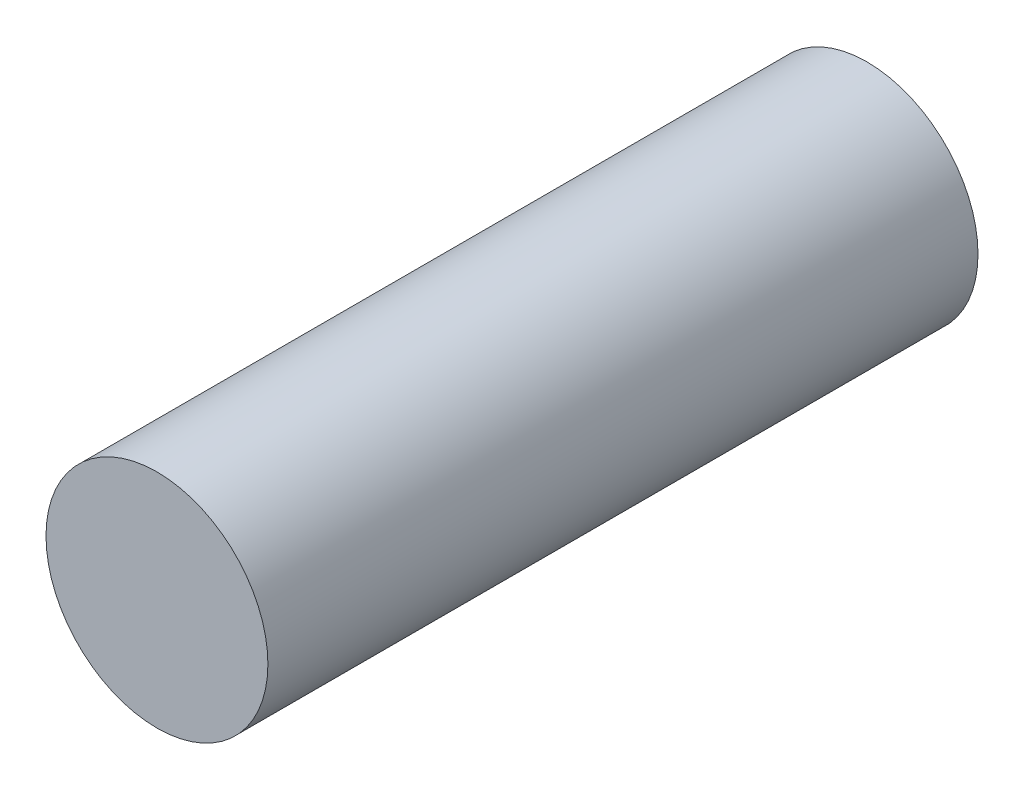
ISO-10303-21;
HEADER;
FILE_DESCRIPTION(('STEP AP214'),'2;1');
FILE_NAME('part.step','',(''),(''),'','','');
FILE_SCHEMA(('AUTOMOTIVE_DESIGN { 1 0 10303 214 1 1 1 1 }'));
ENDSEC;
DATA;
#1=APPLICATION_CONTEXT('core data for automotive mechanical design processes');
#2=APPLICATION_PROTOCOL_DEFINITION('international standard','automotive_design',2000,#1);
#3=PRODUCT_CONTEXT('',#1,'mechanical');
#4=PRODUCT('Part','Part','',(#3));
#5=PRODUCT_RELATED_PRODUCT_CATEGORY('part','',(#4));
#6=PRODUCT_DEFINITION_FORMATION('','',#4);
#7=PRODUCT_DEFINITION_CONTEXT('part definition',#1,'design');
#8=PRODUCT_DEFINITION('design','',#6,#7);
#9=PRODUCT_DEFINITION_SHAPE('','',#8);
#10=(LENGTH_UNIT() NAMED_UNIT(*) SI_UNIT(.MILLI.,.METRE.));
#11=(NAMED_UNIT(*) PLANE_ANGLE_UNIT() SI_UNIT($,.RADIAN.));
#12=(NAMED_UNIT(*) SI_UNIT($,.STERADIAN.) SOLID_ANGLE_UNIT());
#13=UNCERTAINTY_MEASURE_WITH_UNIT(LENGTH_MEASURE(1.E-05),#10,'distance_accuracy_value','');
#14=(GEOMETRIC_REPRESENTATION_CONTEXT(3) GLOBAL_UNCERTAINTY_ASSIGNED_CONTEXT((#13)) GLOBAL_UNIT_ASSIGNED_CONTEXT((#10,
#11,#12)) REPRESENTATION_CONTEXT('',''));
#15=CARTESIAN_POINT('',(0.,0.,0.));
#16=DIRECTION('',(0.,0.,1.));
#17=DIRECTION('',(1.,0.,0.));
#18=AXIS2_PLACEMENT_3D('',#15,#16,#17);
#19=CARTESIAN_POINT('',(0.,0.,32.));
#20=DIRECTION('',(0.,0.,-1.));
#21=DIRECTION('',(-1.,0.,0.));
#22=AXIS2_PLACEMENT_3D('',#19,#20,#21);
#23=CYLINDRICAL_SURFACE('',#22,5.);
#24=CARTESIAN_POINT('',(0.,0.,32.));
#25=DIRECTION('',(0.,0.,1.));
#26=DIRECTION('',(1.,0.,0.));
#27=AXIS2_PLACEMENT_3D('',#24,#25,#26);
#28=CIRCLE('',#27,5.);
#29=CARTESIAN_POINT('',(5.,0.,32.));
#30=VERTEX_POINT('',#29);
#31=EDGE_CURVE('E10',#30,#30,#28,.T.);
#32=ORIENTED_EDGE('',*,*,#31,.F.);
#33=EDGE_LOOP('',(#32));
#34=FACE_BOUND('',#33,.T.);
#35=CARTESIAN_POINT('',(0.,0.,0.));
#36=DIRECTION('',(0.,0.,1.));
#37=DIRECTION('',(1.,0.,0.));
#38=AXIS2_PLACEMENT_3D('',#35,#36,#37);
#39=CIRCLE('',#38,5.);
#40=CARTESIAN_POINT('',(5.,0.,0.));
#41=VERTEX_POINT('',#40);
#42=EDGE_CURVE('E40',#41,#41,#39,.T.);
#43=ORIENTED_EDGE('',*,*,#42,.T.);
#44=EDGE_LOOP('',(#43));
#45=FACE_BOUND('',#44,.T.);
#46=ADVANCED_FACE('F37',(#34,#45),#23,.T.);
#47=CARTESIAN_POINT('',(0.,0.,32.));
#48=DIRECTION('',(0.,0.,1.));
#49=DIRECTION('',(1.,0.,0.));
#50=AXIS2_PLACEMENT_3D('',#47,#48,#49);
#51=PLANE('',#50);
#52=ORIENTED_EDGE('',*,*,#31,.T.);
#53=EDGE_LOOP('',(#52));
#54=FACE_BOUND('',#53,.T.);
#55=ADVANCED_FACE('F54',(#54),#51,.T.);
#56=CARTESIAN_POINT('',(0.,0.,0.));
#57=DIRECTION('',(0.,0.,1.));
#58=DIRECTION('',(1.,0.,0.));
#59=AXIS2_PLACEMENT_3D('',#56,#57,#58);
#60=PLANE('',#59);
#61=ORIENTED_EDGE('',*,*,#42,.F.);
#62=EDGE_LOOP('',(#61));
#63=FACE_BOUND('',#62,.T.);
#64=ADVANCED_FACE('F52',(#63),#60,.F.);
#65=CLOSED_SHELL('',(#46,#55,#64));
#66=MANIFOLD_SOLID_BREP('B2',#65);
#67=ADVANCED_BREP_SHAPE_REPRESENTATION('',(#18,#66),#14);
#68=SHAPE_DEFINITION_REPRESENTATION(#9,#67);
ENDSEC;
END-ISO-10303-21;
